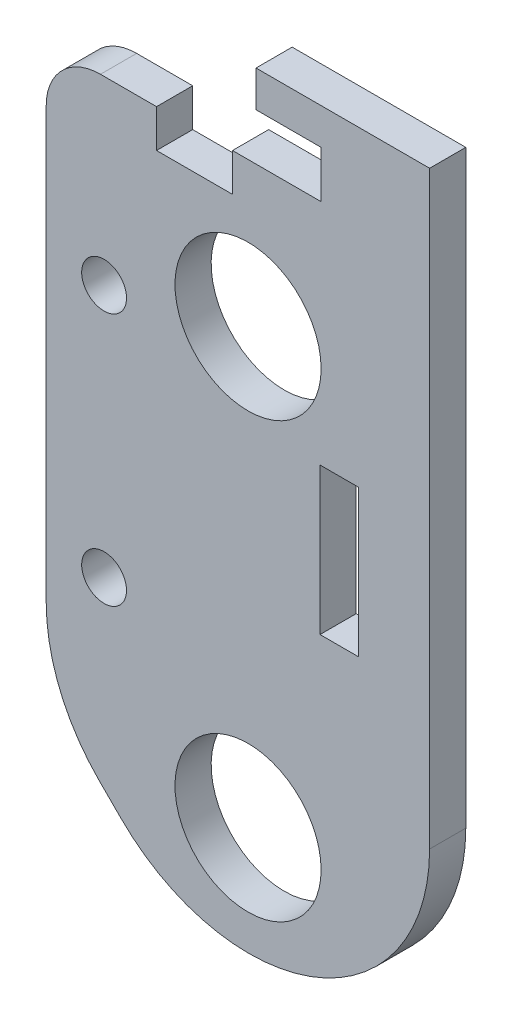
ISO-10303-21;
HEADER;
FILE_DESCRIPTION(('STEP AP214'),'2;1');
FILE_NAME('part.step','',(''),(''),'','','');
FILE_SCHEMA(('AUTOMOTIVE_DESIGN { 1 0 10303 214 1 1 1 1 }'));
ENDSEC;
DATA;
#1=APPLICATION_CONTEXT('core data for automotive mechanical design processes');
#2=APPLICATION_PROTOCOL_DEFINITION('international standard','automotive_design',2000,#1);
#3=PRODUCT_CONTEXT('',#1,'mechanical');
#4=PRODUCT('Part','Part','',(#3));
#5=PRODUCT_RELATED_PRODUCT_CATEGORY('part','',(#4));
#6=PRODUCT_DEFINITION_FORMATION('','',#4);
#7=PRODUCT_DEFINITION_CONTEXT('part definition',#1,'design');
#8=PRODUCT_DEFINITION('design','',#6,#7);
#9=PRODUCT_DEFINITION_SHAPE('','',#8);
#10=(LENGTH_UNIT() NAMED_UNIT(*) SI_UNIT(.MILLI.,.METRE.));
#11=(NAMED_UNIT(*) PLANE_ANGLE_UNIT() SI_UNIT($,.RADIAN.));
#12=(NAMED_UNIT(*) SI_UNIT($,.STERADIAN.) SOLID_ANGLE_UNIT());
#13=UNCERTAINTY_MEASURE_WITH_UNIT(LENGTH_MEASURE(1.E-05),#10,'distance_accuracy_value','');
#14=(GEOMETRIC_REPRESENTATION_CONTEXT(3) GLOBAL_UNCERTAINTY_ASSIGNED_CONTEXT((#13)) GLOBAL_UNIT_ASSIGNED_CONTEXT((#10,
#11,#12)) REPRESENTATION_CONTEXT('',''));
#15=CARTESIAN_POINT('',(0.,0.,0.));
#16=DIRECTION('',(0.,0.,1.));
#17=DIRECTION('',(1.,0.,0.));
#18=AXIS2_PLACEMENT_3D('',#15,#16,#17);
#19=CARTESIAN_POINT('',(-0.149999999999495,-37.6000017024481,5.));
#20=DIRECTION('',(1.,0.,0.));
#21=DIRECTION('',(0.,1.,0.));
#22=AXIS2_PLACEMENT_3D('',#19,#20,#21);
#23=PLANE('',#22);
#24=DIRECTION('',(0.,0.,1.));
#25=VECTOR('',#24,1.);
#26=CARTESIAN_POINT('',(-0.14999999999923,-57.9000017024481,5.));
#27=LINE('',#26,#25);
#28=CARTESIAN_POINT('',(-0.14999999999923,-57.9000017024481,0.));
#29=VERTEX_POINT('',#28);
#30=CARTESIAN_POINT('',(-0.14999999999923,-57.9000017024481,5.));
#31=VERTEX_POINT('',#30);
#32=EDGE_CURVE('E11',#29,#31,#27,.T.);
#33=ORIENTED_EDGE('',*,*,#32,.F.);
#34=DIRECTION('',(0.,1.,0.));
#35=VECTOR('',#34,1.);
#36=CARTESIAN_POINT('',(-0.149999999998459,0.,0.));
#37=LINE('',#36,#35);
#38=CARTESIAN_POINT('',(-0.149999999999495,-37.6000017024481,0.));
#39=VERTEX_POINT('',#38);
#40=EDGE_CURVE('E150',#29,#39,#37,.T.);
#41=ORIENTED_EDGE('',*,*,#40,.T.);
#42=DIRECTION('',(0.,0.,1.));
#43=VECTOR('',#42,1.);
#44=CARTESIAN_POINT('',(-0.149999999999495,-37.6000017024481,5.));
#45=LINE('',#44,#43);
#46=CARTESIAN_POINT('',(-0.149999999999495,-37.6000017024481,5.));
#47=VERTEX_POINT('',#46);
#48=EDGE_CURVE('E55',#39,#47,#45,.T.);
#49=ORIENTED_EDGE('',*,*,#48,.T.);
#50=DIRECTION('',(0.,1.,0.));
#51=VECTOR('',#50,1.);
#52=CARTESIAN_POINT('',(-0.149999999999495,-37.6000017024481,5.));
#53=LINE('',#52,#51);
#54=EDGE_CURVE('E238',#31,#47,#53,.T.);
#55=ORIENTED_EDGE('',*,*,#54,.F.);
#56=EDGE_LOOP('',(#33,#41,#49,#55));
#57=FACE_BOUND('',#56,.T.);
#58=ADVANCED_FACE('F45',(#57),#23,.T.);
#59=CARTESIAN_POINT('',(5.14999820052117,-37.6000017024481,5.));
#60=DIRECTION('',(0.,-1.,0.));
#61=DIRECTION('',(1.,0.,0.));
#62=AXIS2_PLACEMENT_3D('',#59,#60,#61);
#63=PLANE('',#62);
#64=ORIENTED_EDGE('',*,*,#48,.F.);
#65=DIRECTION('',(1.,0.,0.));
#66=VECTOR('',#65,1.);
#67=CARTESIAN_POINT('',(-5.00932651392036E-13,-37.6000017024481,0.));
#68=LINE('',#67,#66);
#69=CARTESIAN_POINT('',(5.14999820052117,-37.6000017024481,0.));
#70=VERTEX_POINT('',#69);
#71=EDGE_CURVE('E166',#39,#70,#68,.T.);
#72=ORIENTED_EDGE('',*,*,#71,.T.);
#73=DIRECTION('',(0.,0.,1.));
#74=VECTOR('',#73,1.);
#75=CARTESIAN_POINT('',(5.14999820052117,-37.6000017024481,5.));
#76=LINE('',#75,#74);
#77=CARTESIAN_POINT('',(5.14999820052117,-37.6000017024481,5.));
#78=VERTEX_POINT('',#77);
#79=EDGE_CURVE('E63',#70,#78,#76,.T.);
#80=ORIENTED_EDGE('',*,*,#79,.T.);
#81=DIRECTION('',(1.,0.,0.));
#82=VECTOR('',#81,1.);
#83=CARTESIAN_POINT('',(5.14999820052117,-37.6000017024481,5.));
#84=LINE('',#83,#82);
#85=EDGE_CURVE('E243',#47,#78,#84,.T.);
#86=ORIENTED_EDGE('',*,*,#85,.F.);
#87=EDGE_LOOP('',(#64,#72,#80,#86));
#88=FACE_BOUND('',#87,.T.);
#89=ADVANCED_FACE('F246',(#88),#63,.T.);
#90=CARTESIAN_POINT('',(5.14999820052117,-37.6000017024481,5.));
#91=DIRECTION('',(-1.,0.,0.));
#92=DIRECTION('',(0.,-1.,0.));
#93=AXIS2_PLACEMENT_3D('',#90,#91,#92);
#94=PLANE('',#93);
#95=ORIENTED_EDGE('',*,*,#79,.F.);
#96=DIRECTION('',(0.,1.,0.));
#97=VECTOR('',#96,1.);
#98=CARTESIAN_POINT('',(5.14999820052167,0.,0.));
#99=LINE('',#98,#97);
#100=CARTESIAN_POINT('',(5.14999820052148,-57.9000017024481,0.));
#101=VERTEX_POINT('',#100);
#102=EDGE_CURVE('E149',#70,#101,#99,.F.);
#103=ORIENTED_EDGE('',*,*,#102,.T.);
#104=DIRECTION('',(0.,0.,1.));
#105=VECTOR('',#104,1.);
#106=CARTESIAN_POINT('',(5.14999820052148,-57.9000017024481,5.));
#107=LINE('',#106,#105);
#108=CARTESIAN_POINT('',(5.14999820052148,-57.9000017024481,5.));
#109=VERTEX_POINT('',#108);
#110=EDGE_CURVE('E49',#101,#109,#107,.T.);
#111=ORIENTED_EDGE('',*,*,#110,.T.);
#112=DIRECTION('',(0.,-1.,0.));
#113=VECTOR('',#112,1.);
#114=CARTESIAN_POINT('',(5.14999820052117,-37.6000017024481,5.));
#115=LINE('',#114,#113);
#116=EDGE_CURVE('E438',#78,#109,#115,.T.);
#117=ORIENTED_EDGE('',*,*,#116,.F.);
#118=EDGE_LOOP('',(#95,#103,#111,#117));
#119=FACE_BOUND('',#118,.T.);
#120=ADVANCED_FACE('F153',(#119),#94,.T.);
#121=CARTESIAN_POINT('',(-30.4999999999999,-13.4999999999996,5.));
#122=DIRECTION('',(0.,0.,1.));
#123=DIRECTION('',(0.,-1.,0.));
#124=AXIS2_PLACEMENT_3D('',#121,#122,#123);
#125=CYLINDRICAL_SURFACE('',#124,7.5);
#126=DIRECTION('',(0.,0.,1.));
#127=VECTOR('',#126,1.);
#128=CARTESIAN_POINT('',(-30.4999999999999,-5.99999999999958,5.));
#129=LINE('',#128,#127);
#130=CARTESIAN_POINT('',(-30.4999999999999,-5.99999999999958,0.));
#131=VERTEX_POINT('',#130);
#132=CARTESIAN_POINT('',(-30.4999999999999,-5.99999999999958,5.));
#133=VERTEX_POINT('',#132);
#134=EDGE_CURVE('E143',#131,#133,#129,.T.);
#135=ORIENTED_EDGE('',*,*,#134,.F.);
#136=CARTESIAN_POINT('',(-30.4999999999999,-13.4999999999996,0.));
#137=DIRECTION('',(0.,0.,1.));
#138=DIRECTION('',(0.,-1.,0.));
#139=AXIS2_PLACEMENT_3D('',#136,#137,#138);
#140=CIRCLE('',#139,7.5);
#141=CARTESIAN_POINT('',(-37.9999999999997,-13.4999999999994,0.));
#142=VERTEX_POINT('',#141);
#143=EDGE_CURVE('E317',#131,#142,#140,.T.);
#144=ORIENTED_EDGE('',*,*,#143,.T.);
#145=DIRECTION('',(0.,0.,1.));
#146=VECTOR('',#145,1.);
#147=CARTESIAN_POINT('',(-37.9999999999997,-13.4999999999994,5.));
#148=LINE('',#147,#146);
#149=CARTESIAN_POINT('',(-37.9999999999997,-13.4999999999994,5.));
#150=VERTEX_POINT('',#149);
#151=EDGE_CURVE('E228',#142,#150,#148,.T.);
#152=ORIENTED_EDGE('',*,*,#151,.T.);
#153=CARTESIAN_POINT('',(-30.4999999999999,-13.4999999999996,5.));
#154=DIRECTION('',(0.,0.,1.));
#155=DIRECTION('',(1.,0.,0.));
#156=AXIS2_PLACEMENT_3D('',#153,#154,#155);
#157=CIRCLE('',#156,7.5);
#158=EDGE_CURVE('E379',#133,#150,#157,.T.);
#159=ORIENTED_EDGE('',*,*,#158,.F.);
#160=EDGE_LOOP('',(#135,#144,#152,#159));
#161=FACE_BOUND('',#160,.T.);
#162=ADVANCED_FACE('F378',(#161),#125,.T.);
#163=CARTESIAN_POINT('',(-37.9999999999997,5.0626169922907E-13,5.));
#164=DIRECTION('',(-1.,0.,0.));
#165=DIRECTION('',(0.,-1.,0.));
#166=AXIS2_PLACEMENT_3D('',#163,#164,#165);
#167=PLANE('',#166);
#168=ORIENTED_EDGE('',*,*,#151,.F.);
#169=DIRECTION('',(0.,1.,0.));
#170=VECTOR('',#169,1.);
#171=CARTESIAN_POINT('',(-37.9999999999995,5.06261699229065E-13,0.));
#172=LINE('',#171,#170);
#173=CARTESIAN_POINT('',(-37.9999999999989,-72.9669914110084,0.));
#174=VERTEX_POINT('',#173);
#175=EDGE_CURVE('E314',#142,#174,#172,.F.);
#176=ORIENTED_EDGE('',*,*,#175,.T.);
#177=DIRECTION('',(0.,0.,1.));
#178=VECTOR('',#177,1.);
#179=CARTESIAN_POINT('',(-37.9999999999989,-72.9669914110084,4.99999999999999));
#180=LINE('',#179,#178);
#181=CARTESIAN_POINT('',(-37.9999999999989,-72.9669914110084,4.99999999999999));
#182=VERTEX_POINT('',#181);
#183=EDGE_CURVE('E225',#174,#182,#180,.T.);
#184=ORIENTED_EDGE('',*,*,#183,.T.);
#185=DIRECTION('',(0.,-1.,0.));
#186=VECTOR('',#185,1.);
#187=CARTESIAN_POINT('',(-37.9999999999997,5.0626169922907E-13,5.));
#188=LINE('',#187,#186);
#189=EDGE_CURVE('E385',#150,#182,#188,.T.);
#190=ORIENTED_EDGE('',*,*,#189,.F.);
#191=EDGE_LOOP('',(#168,#176,#184,#190));
#192=FACE_BOUND('',#191,.T.);
#193=ADVANCED_FACE('F390',(#192),#167,.T.);
#194=CARTESIAN_POINT('',(-12.999999999999,-72.966991411009,5.));
#195=DIRECTION('',(0.,0.,1.));
#196=DIRECTION('',(0.,-1.,0.));
#197=AXIS2_PLACEMENT_3D('',#194,#195,#196);
#198=CYLINDRICAL_SURFACE('',#197,25.);
#199=ORIENTED_EDGE('',*,*,#183,.F.);
#200=CARTESIAN_POINT('',(-12.999999999999,-72.966991411009,0.));
#201=DIRECTION('',(0.,0.,1.));
#202=DIRECTION('',(0.,-1.,0.));
#203=AXIS2_PLACEMENT_3D('',#200,#201,#202);
#204=CIRCLE('',#203,25.);
#205=CARTESIAN_POINT('',(-30.6776695296623,-90.6446609406722,0.));
#206=VERTEX_POINT('',#205);
#207=EDGE_CURVE('E310',#174,#206,#204,.T.);
#208=ORIENTED_EDGE('',*,*,#207,.T.);
#209=DIRECTION('',(0.,0.,1.));
#210=VECTOR('',#209,1.);
#211=CARTESIAN_POINT('',(-30.6776695296623,-90.6446609406722,5.));
#212=LINE('',#211,#210);
#213=CARTESIAN_POINT('',(-30.6776695296623,-90.6446609406722,5.));
#214=VERTEX_POINT('',#213);
#215=EDGE_CURVE('E222',#206,#214,#212,.T.);
#216=ORIENTED_EDGE('',*,*,#215,.T.);
#217=CARTESIAN_POINT('',(-12.999999999999,-72.966991411009,5.));
#218=DIRECTION('',(0.,0.,1.));
#219=DIRECTION('',(1.,0.,0.));
#220=AXIS2_PLACEMENT_3D('',#217,#218,#219);
#221=CIRCLE('',#220,25.);
#222=EDGE_CURVE('E392',#182,#214,#221,.T.);
#223=ORIENTED_EDGE('',*,*,#222,.F.);
#224=EDGE_LOOP('',(#199,#208,#216,#223));
#225=FACE_BOUND('',#224,.T.);
#226=ADVANCED_FACE('F506',(#225),#198,.T.);
#227=CARTESIAN_POINT('',(-60.6611652351669,-60.6611652351678,5.));
#228=DIRECTION('',(-0.707106781186544,-0.707106781186551,0.));
#229=DIRECTION('',(0.70710678118656,-0.707106781186553,0.));
#230=AXIS2_PLACEMENT_3D('',#227,#228,#229);
#231=PLANE('',#230);
#232=ORIENTED_EDGE('',*,*,#215,.F.);
#233=DIRECTION('',(0.70710678118656,-0.707106781186553,0.));
#234=VECTOR('',#233,1.);
#235=CARTESIAN_POINT('',(-60.6611652351669,-60.6611652351678,0.));
#236=LINE('',#235,#234);
#237=CARTESIAN_POINT('',(-27.6446609406713,-93.6776695296632,0.));
#238=VERTEX_POINT('',#237);
#239=EDGE_CURVE('E306',#206,#238,#236,.T.);
#240=ORIENTED_EDGE('',*,*,#239,.T.);
#241=DIRECTION('',(0.,0.,1.));
#242=VECTOR('',#241,1.);
#243=CARTESIAN_POINT('',(-27.6446609406713,-93.6776695296632,5.));
#244=LINE('',#243,#242);
#245=CARTESIAN_POINT('',(-27.6446609406713,-93.6776695296632,5.));
#246=VERTEX_POINT('',#245);
#247=EDGE_CURVE('E219',#238,#246,#244,.T.);
#248=ORIENTED_EDGE('',*,*,#247,.T.);
#249=DIRECTION('',(0.70710678118656,-0.707106781186553,0.));
#250=VECTOR('',#249,1.);
#251=CARTESIAN_POINT('',(-60.6611652351669,-60.6611652351678,5.));
#252=LINE('',#251,#250);
#253=EDGE_CURVE('E396',#214,#246,#252,.T.);
#254=ORIENTED_EDGE('',*,*,#253,.F.);
#255=EDGE_LOOP('',(#232,#240,#248,#254));
#256=FACE_BOUND('',#255,.T.);
#257=ADVANCED_FACE('F504',(#256),#231,.T.);
#258=CARTESIAN_POINT('',(-9.96699141100797,-76.,5.));
#259=DIRECTION('',(0.,0.,1.));
#260=DIRECTION('',(0.,-1.,0.));
#261=AXIS2_PLACEMENT_3D('',#258,#259,#260);
#262=CYLINDRICAL_SURFACE('',#261,25.);
#263=ORIENTED_EDGE('',*,*,#247,.F.);
#264=CARTESIAN_POINT('',(-9.96699141100797,-76.,0.));
#265=DIRECTION('',(0.,0.,1.));
#266=DIRECTION('',(0.,-1.,0.));
#267=AXIS2_PLACEMENT_3D('',#264,#265,#266);
#268=CIRCLE('',#267,25.);
#269=CARTESIAN_POINT('',(-9.98349570550315,-101.,0.));
#270=VERTEX_POINT('',#269);
#271=EDGE_CURVE('E302',#238,#270,#268,.T.);
#272=ORIENTED_EDGE('',*,*,#271,.T.);
#273=DIRECTION('',(0.,0.,1.));
#274=VECTOR('',#273,1.);
#275=CARTESIAN_POINT('',(-9.98349570550315,-101.,5.));
#276=LINE('',#275,#274);
#277=CARTESIAN_POINT('',(-9.98349570550315,-101.,5.));
#278=VERTEX_POINT('',#277);
#279=EDGE_CURVE('E216',#270,#278,#276,.T.);
#280=ORIENTED_EDGE('',*,*,#279,.T.);
#281=CARTESIAN_POINT('',(-9.96699141100797,-76.,5.));
#282=DIRECTION('',(0.,0.,1.));
#283=DIRECTION('',(1.,0.,0.));
#284=AXIS2_PLACEMENT_3D('',#281,#282,#283);
#285=CIRCLE('',#284,25.);
#286=EDGE_CURVE('E403',#246,#278,#285,.T.);
#287=ORIENTED_EDGE('',*,*,#286,.F.);
#288=EDGE_LOOP('',(#263,#272,#280,#287));
#289=FACE_BOUND('',#288,.T.);
#290=ADVANCED_FACE('F499',(#289),#262,.T.);
#291=CARTESIAN_POINT('',(-9.99999999999903,-76.,5.));
#292=DIRECTION('',(0.,0.,1.));
#293=DIRECTION('',(0.,-1.,0.));
#294=AXIS2_PLACEMENT_3D('',#291,#292,#293);
#295=CYLINDRICAL_SURFACE('',#294,25.);
#296=ORIENTED_EDGE('',*,*,#279,.F.);
#297=CARTESIAN_POINT('',(-9.99999999999903,-76.,0.));
#298=DIRECTION('',(0.,0.,1.));
#299=DIRECTION('',(0.,-1.,0.));
#300=AXIS2_PLACEMENT_3D('',#297,#298,#299);
#301=CIRCLE('',#300,25.);
#302=CARTESIAN_POINT('',(15.000000000001,-76.,0.));
#303=VERTEX_POINT('',#302);
#304=EDGE_CURVE('E298',#270,#303,#301,.T.);
#305=ORIENTED_EDGE('',*,*,#304,.T.);
#306=DIRECTION('',(0.,0.,1.));
#307=VECTOR('',#306,1.);
#308=CARTESIAN_POINT('',(15.000000000001,-76.,4.99999999999999));
#309=LINE('',#308,#307);
#310=CARTESIAN_POINT('',(15.000000000001,-76.,4.99999999999999));
#311=VERTEX_POINT('',#310);
#312=EDGE_CURVE('E213',#303,#311,#309,.T.);
#313=ORIENTED_EDGE('',*,*,#312,.T.);
#314=CARTESIAN_POINT('',(-9.99999999999903,-76.,5.));
#315=DIRECTION('',(0.,0.,1.));
#316=DIRECTION('',(1.,0.,0.));
#317=AXIS2_PLACEMENT_3D('',#314,#315,#316);
#318=CIRCLE('',#317,25.);
#319=EDGE_CURVE('E407',#278,#311,#318,.T.);
#320=ORIENTED_EDGE('',*,*,#319,.F.);
#321=EDGE_LOOP('',(#296,#305,#313,#320));
#322=FACE_BOUND('',#321,.T.);
#323=ADVANCED_FACE('F495',(#322),#295,.T.);
#324=CARTESIAN_POINT('',(15.,-1.99840144432528E-13,4.99999999999999));
#325=DIRECTION('',(-1.,0.,0.));
#326=DIRECTION('',(0.,-1.,0.));
#327=AXIS2_PLACEMENT_3D('',#324,#325,#326);
#328=PLANE('',#327);
#329=ORIENTED_EDGE('',*,*,#312,.F.);
#330=DIRECTION('',(0.,1.,0.));
#331=VECTOR('',#330,1.);
#332=CARTESIAN_POINT('',(14.9999999999999,-1.99840144432526E-13,0.));
#333=LINE('',#332,#331);
#334=CARTESIAN_POINT('',(14.9999999999999,5.4999999999998,0.));
#335=VERTEX_POINT('',#334);
#336=EDGE_CURVE('E294',#335,#303,#333,.F.);
#337=ORIENTED_EDGE('',*,*,#336,.F.);
#338=DIRECTION('',(0.,0.,1.));
#339=VECTOR('',#338,1.);
#340=CARTESIAN_POINT('',(14.9999999999999,5.4999999999998,4.99999999999999));
#341=LINE('',#340,#339);
#342=CARTESIAN_POINT('',(14.9999999999999,5.4999999999998,4.99999999999999));
#343=VERTEX_POINT('',#342);
#344=EDGE_CURVE('E210',#335,#343,#341,.T.);
#345=ORIENTED_EDGE('',*,*,#344,.T.);
#346=DIRECTION('',(0.,-1.,0.));
#347=VECTOR('',#346,1.);
#348=CARTESIAN_POINT('',(15.,-1.99840144432528E-13,4.99999999999999));
#349=LINE('',#348,#347);
#350=EDGE_CURVE('E411',#343,#311,#349,.T.);
#351=ORIENTED_EDGE('',*,*,#350,.T.);
#352=EDGE_LOOP('',(#329,#337,#345,#351));
#353=FACE_BOUND('',#352,.T.);
#354=ADVANCED_FACE('F492',(#353),#328,.F.);
#355=CARTESIAN_POINT('',(0.,5.50000000000001,5.));
#356=DIRECTION('',(0.,-1.,0.));
#357=DIRECTION('',(1.,0.,0.));
#358=AXIS2_PLACEMENT_3D('',#355,#356,#357);
#359=PLANE('',#358);
#360=ORIENTED_EDGE('',*,*,#344,.F.);
#361=DIRECTION('',(1.,0.,0.));
#362=VECTOR('',#361,1.);
#363=CARTESIAN_POINT('',(0.,5.50000000000003,0.));
#364=LINE('',#363,#362);
#365=CARTESIAN_POINT('',(-9.00000000000007,5.50000000000015,0.));
#366=VERTEX_POINT('',#365);
#367=EDGE_CURVE('E290',#366,#335,#364,.T.);
#368=ORIENTED_EDGE('',*,*,#367,.F.);
#369=DIRECTION('',(0.,0.,1.));
#370=VECTOR('',#369,1.);
#371=CARTESIAN_POINT('',(-9.00000000000007,5.50000000000015,5.));
#372=LINE('',#371,#370);
#373=CARTESIAN_POINT('',(-9.00000000000007,5.50000000000015,5.));
#374=VERTEX_POINT('',#373);
#375=EDGE_CURVE('E207',#366,#374,#372,.T.);
#376=ORIENTED_EDGE('',*,*,#375,.T.);
#377=DIRECTION('',(1.,0.,0.));
#378=VECTOR('',#377,1.);
#379=CARTESIAN_POINT('',(0.,5.50000000000001,5.));
#380=LINE('',#379,#378);
#381=EDGE_CURVE('E415',#374,#343,#380,.T.);
#382=ORIENTED_EDGE('',*,*,#381,.T.);
#383=EDGE_LOOP('',(#360,#368,#376,#382));
#384=FACE_BOUND('',#383,.T.);
#385=ADVANCED_FACE('F487',(#384),#359,.F.);
#386=CARTESIAN_POINT('',(-9.,1.33781874467331E-13,5.));
#387=DIRECTION('',(1.,0.,0.));
#388=DIRECTION('',(0.,1.,0.));
#389=AXIS2_PLACEMENT_3D('',#386,#387,#388);
#390=PLANE('',#389);
#391=ORIENTED_EDGE('',*,*,#375,.F.);
#392=DIRECTION('',(0.,1.,0.));
#393=VECTOR('',#392,1.);
#394=CARTESIAN_POINT('',(-9.00000000000001,1.19904086659517E-13,0.));
#395=LINE('',#394,#393);
#396=CARTESIAN_POINT('',(-9.,0.500000000000136,0.));
#397=VERTEX_POINT('',#396);
#398=EDGE_CURVE('E286',#397,#366,#395,.T.);
#399=ORIENTED_EDGE('',*,*,#398,.F.);
#400=DIRECTION('',(0.,0.,1.));
#401=VECTOR('',#400,1.);
#402=CARTESIAN_POINT('',(-9.,0.500000000000136,5.));
#403=LINE('',#402,#401);
#404=CARTESIAN_POINT('',(-9.,0.500000000000136,5.));
#405=VERTEX_POINT('',#404);
#406=EDGE_CURVE('E204',#397,#405,#403,.T.);
#407=ORIENTED_EDGE('',*,*,#406,.T.);
#408=DIRECTION('',(0.,1.,0.));
#409=VECTOR('',#408,1.);
#410=CARTESIAN_POINT('',(-9.,1.33781874467331E-13,5.));
#411=LINE('',#410,#409);
#412=EDGE_CURVE('E419',#405,#374,#411,.T.);
#413=ORIENTED_EDGE('',*,*,#412,.T.);
#414=EDGE_LOOP('',(#391,#399,#407,#413));
#415=FACE_BOUND('',#414,.T.);
#416=ADVANCED_FACE('F483',(#415),#390,.F.);
#417=CARTESIAN_POINT('',(0.,0.5,5.));
#418=DIRECTION('',(0.,-1.,0.));
#419=DIRECTION('',(1.,0.,0.));
#420=AXIS2_PLACEMENT_3D('',#417,#418,#419);
#421=PLANE('',#420);
#422=ORIENTED_EDGE('',*,*,#406,.F.);
#423=DIRECTION('',(1.,0.,0.));
#424=VECTOR('',#423,1.);
#425=CARTESIAN_POINT('',(0.,0.500000000000016,0.));
#426=LINE('',#425,#424);
#427=CARTESIAN_POINT('',(0.,0.5,0.));
#428=VERTEX_POINT('',#427);
#429=EDGE_CURVE('E282',#397,#428,#426,.T.);
#430=ORIENTED_EDGE('',*,*,#429,.T.);
#431=DIRECTION('',(0.,0.,1.));
#432=VECTOR('',#431,1.);
#433=CARTESIAN_POINT('',(0.,0.5,5.));
#434=LINE('',#433,#432);
#435=CARTESIAN_POINT('',(0.,0.5,5.));
#436=VERTEX_POINT('',#435);
#437=EDGE_CURVE('E201',#428,#436,#434,.T.);
#438=ORIENTED_EDGE('',*,*,#437,.T.);
#439=DIRECTION('',(1.,0.,0.));
#440=VECTOR('',#439,1.);
#441=CARTESIAN_POINT('',(0.,0.5,5.));
#442=LINE('',#441,#440);
#443=EDGE_CURVE('E423',#405,#436,#442,.T.);
#444=ORIENTED_EDGE('',*,*,#443,.F.);
#445=EDGE_LOOP('',(#422,#430,#438,#444));
#446=FACE_BOUND('',#445,.T.);
#447=ADVANCED_FACE('F479',(#446),#421,.T.);
#448=CARTESIAN_POINT('',(0.,0.,5.));
#449=DIRECTION('',(-1.,0.,0.));
#450=DIRECTION('',(0.,-1.,0.));
#451=AXIS2_PLACEMENT_3D('',#448,#449,#450);
#452=PLANE('',#451);
#453=ORIENTED_EDGE('',*,*,#437,.F.);
#454=DIRECTION('',(0.,1.,0.));
#455=VECTOR('',#454,1.);
#456=CARTESIAN_POINT('',(0.,0.,0.));
#457=LINE('',#456,#455);
#458=CARTESIAN_POINT('',(0.,-6.,0.));
#459=VERTEX_POINT('',#458);
#460=EDGE_CURVE('E278',#428,#459,#457,.F.);
#461=ORIENTED_EDGE('',*,*,#460,.T.);
#462=DIRECTION('',(0.,0.,1.));
#463=VECTOR('',#462,1.);
#464=CARTESIAN_POINT('',(0.,-6.,5.));
#465=LINE('',#464,#463);
#466=CARTESIAN_POINT('',(0.,-6.,5.));
#467=VERTEX_POINT('',#466);
#468=EDGE_CURVE('E198',#459,#467,#465,.T.);
#469=ORIENTED_EDGE('',*,*,#468,.T.);
#470=DIRECTION('',(0.,-1.,0.));
#471=VECTOR('',#470,1.);
#472=CARTESIAN_POINT('',(0.,0.,5.));
#473=LINE('',#472,#471);
#474=EDGE_CURVE('E427',#436,#467,#473,.T.);
#475=ORIENTED_EDGE('',*,*,#474,.F.);
#476=EDGE_LOOP('',(#453,#461,#469,#475));
#477=FACE_BOUND('',#476,.T.);
#478=ADVANCED_FACE('F475',(#477),#452,.T.);
#479=CARTESIAN_POINT('',(0.,-6.,5.));
#480=DIRECTION('',(0.,1.,0.));
#481=DIRECTION('',(-1.,0.,0.));
#482=AXIS2_PLACEMENT_3D('',#479,#480,#481);
#483=PLANE('',#482);
#484=ORIENTED_EDGE('',*,*,#468,.F.);
#485=DIRECTION('',(1.,0.,0.));
#486=VECTOR('',#485,1.);
#487=CARTESIAN_POINT('',(0.,-6.,0.));
#488=LINE('',#487,#486);
#489=CARTESIAN_POINT('',(-12.2499999999999,-5.99999999999982,0.));
#490=VERTEX_POINT('',#489);
#491=EDGE_CURVE('E274',#459,#490,#488,.F.);
#492=ORIENTED_EDGE('',*,*,#491,.T.);
#493=DIRECTION('',(0.,0.,1.));
#494=VECTOR('',#493,1.);
#495=CARTESIAN_POINT('',(-12.2499999999999,-5.99999999999982,5.));
#496=LINE('',#495,#494);
#497=CARTESIAN_POINT('',(-12.2499999999999,-5.99999999999982,5.));
#498=VERTEX_POINT('',#497);
#499=EDGE_CURVE('E195',#490,#498,#496,.T.);
#500=ORIENTED_EDGE('',*,*,#499,.T.);
#501=DIRECTION('',(-1.,0.,0.));
#502=VECTOR('',#501,1.);
#503=CARTESIAN_POINT('',(0.,-6.,5.));
#504=LINE('',#503,#502);
#505=EDGE_CURVE('E431',#467,#498,#504,.T.);
#506=ORIENTED_EDGE('',*,*,#505,.F.);
#507=EDGE_LOOP('',(#484,#492,#500,#506));
#508=FACE_BOUND('',#507,.T.);
#509=ADVANCED_FACE('F473',(#508),#483,.T.);
#510=CARTESIAN_POINT('',(-12.25,1.63202784619898E-13,5.));
#511=DIRECTION('',(1.,0.,0.));
#512=DIRECTION('',(0.,1.,0.));
#513=AXIS2_PLACEMENT_3D('',#510,#511,#512);
#514=PLANE('',#513);
#515=ORIENTED_EDGE('',*,*,#499,.F.);
#516=DIRECTION('',(0.,1.,0.));
#517=VECTOR('',#516,1.);
#518=CARTESIAN_POINT('',(-12.2499999999997,1.63202784619894E-13,0.));
#519=LINE('',#518,#517);
#520=CARTESIAN_POINT('',(-12.2499999999999,-11.2499999999999,0.));
#521=VERTEX_POINT('',#520);
#522=EDGE_CURVE('E160',#521,#490,#519,.T.);
#523=ORIENTED_EDGE('',*,*,#522,.F.);
#524=DIRECTION('',(0.,0.,1.));
#525=VECTOR('',#524,1.);
#526=CARTESIAN_POINT('',(-12.2499999999999,-11.2499999999999,5.));
#527=LINE('',#526,#525);
#528=CARTESIAN_POINT('',(-12.2499999999999,-11.2499999999999,5.));
#529=VERTEX_POINT('',#528);
#530=EDGE_CURVE('E191',#521,#529,#527,.T.);
#531=ORIENTED_EDGE('',*,*,#530,.T.);
#532=DIRECTION('',(0.,1.,0.));
#533=VECTOR('',#532,1.);
#534=CARTESIAN_POINT('',(-12.25,1.63202784619898E-13,5.));
#535=LINE('',#534,#533);
#536=EDGE_CURVE('E432',#529,#498,#535,.T.);
#537=ORIENTED_EDGE('',*,*,#536,.T.);
#538=EDGE_LOOP('',(#515,#523,#531,#537));
#539=FACE_BOUND('',#538,.T.);
#540=ADVANCED_FACE('F469',(#539),#514,.F.);
#541=CARTESIAN_POINT('',(1.49880108324396E-13,-11.25,5.));
#542=DIRECTION('',(0.,-1.,0.));
#543=DIRECTION('',(1.,0.,0.));
#544=AXIS2_PLACEMENT_3D('',#541,#542,#543);
#545=PLANE('',#544);
#546=ORIENTED_EDGE('',*,*,#530,.F.);
#547=DIRECTION('',(1.,0.,0.));
#548=VECTOR('',#547,1.);
#549=CARTESIAN_POINT('',(-1.49880108324396E-13,-11.25,0.));
#550=LINE('',#549,#548);
#551=CARTESIAN_POINT('',(-22.7499999999999,-11.2499999999997,0.));
#552=VERTEX_POINT('',#551);
#553=EDGE_CURVE('E155',#552,#521,#550,.T.);
#554=ORIENTED_EDGE('',*,*,#553,.F.);
#555=DIRECTION('',(0.,0.,1.));
#556=VECTOR('',#555,1.);
#557=CARTESIAN_POINT('',(-22.7499999999999,-11.2499999999997,5.));
#558=LINE('',#557,#556);
#559=CARTESIAN_POINT('',(-22.7499999999999,-11.2499999999997,5.));
#560=VERTEX_POINT('',#559);
#561=EDGE_CURVE('E188',#552,#560,#558,.T.);
#562=ORIENTED_EDGE('',*,*,#561,.T.);
#563=DIRECTION('',(1.,0.,0.));
#564=VECTOR('',#563,1.);
#565=CARTESIAN_POINT('',(1.49880108324396E-13,-11.25,5.));
#566=LINE('',#565,#564);
#567=EDGE_CURVE('E346',#560,#529,#566,.T.);
#568=ORIENTED_EDGE('',*,*,#567,.T.);
#569=EDGE_LOOP('',(#546,#554,#562,#568));
#570=FACE_BOUND('',#569,.T.);
#571=ADVANCED_FACE('F344',(#570),#545,.F.);
#572=CARTESIAN_POINT('',(-22.75,3.16968673530483E-13,5.));
#573=DIRECTION('',(-1.,0.,0.));
#574=DIRECTION('',(0.,-1.,0.));
#575=AXIS2_PLACEMENT_3D('',#572,#573,#574);
#576=PLANE('',#575);
#577=ORIENTED_EDGE('',*,*,#561,.F.);
#578=DIRECTION('',(0.,1.,0.));
#579=VECTOR('',#578,1.);
#580=CARTESIAN_POINT('',(-22.7499999999998,3.03090885722665E-13,0.));
#581=LINE('',#580,#579);
#582=CARTESIAN_POINT('',(-22.7499999999999,-5.99999999999968,0.));
#583=VERTEX_POINT('',#582);
#584=EDGE_CURVE('E267',#583,#552,#581,.F.);
#585=ORIENTED_EDGE('',*,*,#584,.F.);
#586=DIRECTION('',(0.,0.,1.));
#587=VECTOR('',#586,1.);
#588=CARTESIAN_POINT('',(-22.7499999999999,-5.99999999999968,5.));
#589=LINE('',#588,#587);
#590=CARTESIAN_POINT('',(-22.7499999999999,-5.99999999999968,5.));
#591=VERTEX_POINT('',#590);
#592=EDGE_CURVE('E192',#583,#591,#589,.T.);
#593=ORIENTED_EDGE('',*,*,#592,.T.);
#594=DIRECTION('',(0.,-1.,0.));
#595=VECTOR('',#594,1.);
#596=CARTESIAN_POINT('',(-22.75,3.16968673530483E-13,5.));
#597=LINE('',#596,#595);
#598=EDGE_CURVE('E187',#591,#560,#597,.T.);
#599=ORIENTED_EDGE('',*,*,#598,.T.);
#600=EDGE_LOOP('',(#577,#585,#593,#599));
#601=FACE_BOUND('',#600,.T.);
#602=ADVANCED_FACE('F337',(#601),#576,.F.);
#603=DIRECTION('',(1.,0.,0.));
#604=VECTOR('',#603,1.);
#605=CARTESIAN_POINT('',(0.,-5.99999999999998,0.));
#606=LINE('',#605,#604);
#607=EDGE_CURVE('E164',#583,#131,#606,.F.);
#608=ORIENTED_EDGE('',*,*,#607,.T.);
#609=ORIENTED_EDGE('',*,*,#134,.T.);
#610=EDGE_CURVE('E387',#591,#133,#504,.T.);
#611=ORIENTED_EDGE('',*,*,#610,.F.);
#612=ORIENTED_EDGE('',*,*,#592,.F.);
#613=EDGE_LOOP('',(#608,#609,#611,#612));
#614=FACE_BOUND('',#613,.T.);
#615=ADVANCED_FACE('F328',(#614),#483,.T.);
#616=CARTESIAN_POINT('',(5.14999820052148,-57.9000017024481,5.));
#617=DIRECTION('',(0.,1.,0.));
#618=DIRECTION('',(-1.,0.,0.));
#619=AXIS2_PLACEMENT_3D('',#616,#617,#618);
#620=PLANE('',#619);
#621=DIRECTION('',(1.,0.,0.));
#622=VECTOR('',#621,1.);
#623=CARTESIAN_POINT('',(-7.71382980190723E-13,-57.900001702448,0.));
#624=LINE('',#623,#622);
#625=EDGE_CURVE('E136',#101,#29,#624,.F.);
#626=ORIENTED_EDGE('',*,*,#625,.T.);
#627=ORIENTED_EDGE('',*,*,#32,.T.);
#628=DIRECTION('',(-1.,0.,0.));
#629=VECTOR('',#628,1.);
#630=CARTESIAN_POINT('',(5.14999820052148,-57.9000017024481,5.));
#631=LINE('',#630,#629);
#632=EDGE_CURVE('E139',#109,#31,#631,.T.);
#633=ORIENTED_EDGE('',*,*,#632,.F.);
#634=ORIENTED_EDGE('',*,*,#110,.F.);
#635=EDGE_LOOP('',(#626,#627,#633,#634));
#636=FACE_BOUND('',#635,.T.);
#637=ADVANCED_FACE('F135',(#636),#620,.T.);
#638=CARTESIAN_POINT('',(-29.999999999999,-65.9999999999994,5.));
#639=DIRECTION('',(0.,0.,1.));
#640=DIRECTION('',(0.,-1.,0.));
#641=AXIS2_PLACEMENT_3D('',#638,#639,#640);
#642=CYLINDRICAL_SURFACE('',#641,3.1);
#643=CARTESIAN_POINT('',(-29.999999999999,-65.9999999999994,5.));
#644=DIRECTION('',(0.,0.,1.));
#645=DIRECTION('',(1.,0.,0.));
#646=AXIS2_PLACEMENT_3D('',#643,#644,#645);
#647=CIRCLE('',#646,3.1);
#648=CARTESIAN_POINT('',(-26.899999999999,-65.9999999999995,5.));
#649=VERTEX_POINT('',#648);
#650=EDGE_CURVE('E248',#649,#649,#647,.T.);
#651=ORIENTED_EDGE('',*,*,#650,.T.);
#652=EDGE_LOOP('',(#651));
#653=FACE_BOUND('',#652,.T.);
#654=CARTESIAN_POINT('',(-29.999999999999,-65.9999999999994,0.));
#655=DIRECTION('',(0.,0.,1.));
#656=DIRECTION('',(0.,-1.,0.));
#657=AXIS2_PLACEMENT_3D('',#654,#655,#656);
#658=CIRCLE('',#657,3.1);
#659=CARTESIAN_POINT('',(-29.999999999999,-69.0999999999995,0.));
#660=VERTEX_POINT('',#659);
#661=EDGE_CURVE('E169',#660,#660,#658,.T.);
#662=ORIENTED_EDGE('',*,*,#661,.F.);
#663=EDGE_LOOP('',(#662));
#664=FACE_BOUND('',#663,.T.);
#665=ADVANCED_FACE('F525',(#653,#664),#642,.F.);
#666=CARTESIAN_POINT('',(-29.9999999999996,-30.9999999999996,5.));
#667=DIRECTION('',(0.,0.,1.));
#668=DIRECTION('',(0.,-1.,0.));
#669=AXIS2_PLACEMENT_3D('',#666,#667,#668);
#670=CYLINDRICAL_SURFACE('',#669,3.1);
#671=CARTESIAN_POINT('',(-29.9999999999996,-30.9999999999996,5.));
#672=DIRECTION('',(0.,0.,1.));
#673=DIRECTION('',(1.,0.,0.));
#674=AXIS2_PLACEMENT_3D('',#671,#672,#673);
#675=CIRCLE('',#674,3.1);
#676=CARTESIAN_POINT('',(-26.8999999999996,-30.9999999999996,5.));
#677=VERTEX_POINT('',#676);
#678=EDGE_CURVE('E253',#677,#677,#675,.T.);
#679=ORIENTED_EDGE('',*,*,#678,.T.);
#680=EDGE_LOOP('',(#679));
#681=FACE_BOUND('',#680,.T.);
#682=CARTESIAN_POINT('',(-29.9999999999996,-30.9999999999996,0.));
#683=DIRECTION('',(0.,0.,1.));
#684=DIRECTION('',(0.,-1.,0.));
#685=AXIS2_PLACEMENT_3D('',#682,#683,#684);
#686=CIRCLE('',#685,3.1);
#687=CARTESIAN_POINT('',(-29.9999999999996,-34.0999999999996,0.));
#688=VERTEX_POINT('',#687);
#689=EDGE_CURVE('E175',#688,#688,#686,.T.);
#690=ORIENTED_EDGE('',*,*,#689,.F.);
#691=EDGE_LOOP('',(#690));
#692=FACE_BOUND('',#691,.T.);
#693=ADVANCED_FACE('F528',(#681,#692),#670,.F.);
#694=CARTESIAN_POINT('',(-10.0999999999989,-86.,5.));
#695=DIRECTION('',(0.,0.,1.));
#696=DIRECTION('',(0.,-1.,0.));
#697=AXIS2_PLACEMENT_3D('',#694,#695,#696);
#698=CYLINDRICAL_SURFACE('',#697,10.1);
#699=CARTESIAN_POINT('',(-10.0999999999989,-86.,5.));
#700=DIRECTION('',(0.,0.,1.));
#701=DIRECTION('',(1.,0.,0.));
#702=AXIS2_PLACEMENT_3D('',#699,#700,#701);
#703=CIRCLE('',#702,10.1);
#704=CARTESIAN_POINT('',(1.10848830114918E-12,-86.0000000000001,5.));
#705=VERTEX_POINT('',#704);
#706=EDGE_CURVE('E260',#705,#705,#703,.T.);
#707=ORIENTED_EDGE('',*,*,#706,.T.);
#708=EDGE_LOOP('',(#707));
#709=FACE_BOUND('',#708,.T.);
#710=CARTESIAN_POINT('',(-10.0999999999989,-86.,0.));
#711=DIRECTION('',(0.,0.,1.));
#712=DIRECTION('',(0.,-1.,0.));
#713=AXIS2_PLACEMENT_3D('',#710,#711,#712);
#714=CIRCLE('',#713,10.1);
#715=CARTESIAN_POINT('',(-10.0999999999989,-96.1,0.));
#716=VERTEX_POINT('',#715);
#717=EDGE_CURVE('E179',#716,#716,#714,.T.);
#718=ORIENTED_EDGE('',*,*,#717,.F.);
#719=EDGE_LOOP('',(#718));
#720=FACE_BOUND('',#719,.T.);
#721=ADVANCED_FACE('F531',(#709,#720),#698,.F.);
#722=CARTESIAN_POINT('',(-10.0999999999996,-25.9999999999999,5.));
#723=DIRECTION('',(0.,0.,1.));
#724=DIRECTION('',(0.,-1.,0.));
#725=AXIS2_PLACEMENT_3D('',#722,#723,#724);
#726=CYLINDRICAL_SURFACE('',#725,10.1);
#727=CARTESIAN_POINT('',(-10.0999999999996,-25.9999999999999,5.));
#728=DIRECTION('',(0.,0.,1.));
#729=DIRECTION('',(1.,0.,0.));
#730=AXIS2_PLACEMENT_3D('',#727,#728,#729);
#731=CIRCLE('',#730,10.1);
#732=CARTESIAN_POINT('',(3.55618312575245E-13,-26.,5.));
#733=VERTEX_POINT('',#732);
#734=EDGE_CURVE('E235',#733,#733,#731,.T.);
#735=ORIENTED_EDGE('',*,*,#734,.T.);
#736=EDGE_LOOP('',(#735));
#737=FACE_BOUND('',#736,.T.);
#738=CARTESIAN_POINT('',(-10.0999999999996,-25.9999999999999,0.));
#739=DIRECTION('',(0.,0.,1.));
#740=DIRECTION('',(0.,-1.,0.));
#741=AXIS2_PLACEMENT_3D('',#738,#739,#740);
#742=CIRCLE('',#741,10.1);
#743=CARTESIAN_POINT('',(-10.0999999999996,-36.0999999999999,0.));
#744=VERTEX_POINT('',#743);
#745=EDGE_CURVE('E183',#744,#744,#742,.T.);
#746=ORIENTED_EDGE('',*,*,#745,.F.);
#747=EDGE_LOOP('',(#746));
#748=FACE_BOUND('',#747,.T.);
#749=ADVANCED_FACE('F47',(#737,#748),#726,.F.);
#750=CARTESIAN_POINT('',(0.,0.,5.));
#751=DIRECTION('',(0.,0.,1.));
#752=DIRECTION('',(1.,0.,0.));
#753=AXIS2_PLACEMENT_3D('',#750,#751,#752);
#754=PLANE('',#753);
#755=ORIENTED_EDGE('',*,*,#598,.F.);
#756=ORIENTED_EDGE('',*,*,#610,.T.);
#757=ORIENTED_EDGE('',*,*,#158,.T.);
#758=ORIENTED_EDGE('',*,*,#189,.T.);
#759=ORIENTED_EDGE('',*,*,#222,.T.);
#760=ORIENTED_EDGE('',*,*,#253,.T.);
#761=ORIENTED_EDGE('',*,*,#286,.T.);
#762=ORIENTED_EDGE('',*,*,#319,.T.);
#763=ORIENTED_EDGE('',*,*,#350,.F.);
#764=ORIENTED_EDGE('',*,*,#381,.F.);
#765=ORIENTED_EDGE('',*,*,#412,.F.);
#766=ORIENTED_EDGE('',*,*,#443,.T.);
#767=ORIENTED_EDGE('',*,*,#474,.T.);
#768=ORIENTED_EDGE('',*,*,#505,.T.);
#769=ORIENTED_EDGE('',*,*,#536,.F.);
#770=ORIENTED_EDGE('',*,*,#567,.F.);
#771=EDGE_LOOP('',(#755,#756,#757,#758,#759,#760,#761,#762,#763,#764,#765,#766,#767,#768,#769,#770));
#772=FACE_BOUND('',#771,.T.);
#773=ORIENTED_EDGE('',*,*,#116,.T.);
#774=ORIENTED_EDGE('',*,*,#632,.T.);
#775=ORIENTED_EDGE('',*,*,#54,.T.);
#776=ORIENTED_EDGE('',*,*,#85,.T.);
#777=EDGE_LOOP('',(#773,#774,#775,#776));
#778=FACE_BOUND('',#777,.T.);
#779=ORIENTED_EDGE('',*,*,#650,.F.);
#780=EDGE_LOOP('',(#779));
#781=FACE_BOUND('',#780,.T.);
#782=ORIENTED_EDGE('',*,*,#678,.F.);
#783=EDGE_LOOP('',(#782));
#784=FACE_BOUND('',#783,.T.);
#785=ORIENTED_EDGE('',*,*,#706,.F.);
#786=EDGE_LOOP('',(#785));
#787=FACE_BOUND('',#786,.T.);
#788=ORIENTED_EDGE('',*,*,#734,.F.);
#789=EDGE_LOOP('',(#788));
#790=FACE_BOUND('',#789,.T.);
#791=ADVANCED_FACE('F241',(#772,#778,#781,#784,#787,#790),#754,.T.);
#792=CARTESIAN_POINT('',(0.,0.,0.));
#793=DIRECTION('',(0.,0.,1.));
#794=DIRECTION('',(1.,0.,0.));
#795=AXIS2_PLACEMENT_3D('',#792,#793,#794);
#796=PLANE('',#795);
#797=ORIENTED_EDGE('',*,*,#584,.T.);
#798=ORIENTED_EDGE('',*,*,#553,.T.);
#799=ORIENTED_EDGE('',*,*,#522,.T.);
#800=ORIENTED_EDGE('',*,*,#491,.F.);
#801=ORIENTED_EDGE('',*,*,#460,.F.);
#802=ORIENTED_EDGE('',*,*,#429,.F.);
#803=ORIENTED_EDGE('',*,*,#398,.T.);
#804=ORIENTED_EDGE('',*,*,#367,.T.);
#805=ORIENTED_EDGE('',*,*,#336,.T.);
#806=ORIENTED_EDGE('',*,*,#304,.F.);
#807=ORIENTED_EDGE('',*,*,#271,.F.);
#808=ORIENTED_EDGE('',*,*,#239,.F.);
#809=ORIENTED_EDGE('',*,*,#207,.F.);
#810=ORIENTED_EDGE('',*,*,#175,.F.);
#811=ORIENTED_EDGE('',*,*,#143,.F.);
#812=ORIENTED_EDGE('',*,*,#607,.F.);
#813=EDGE_LOOP('',(#797,#798,#799,#800,#801,#802,#803,#804,#805,#806,#807,#808,#809,#810,#811,#812));
#814=FACE_BOUND('',#813,.T.);
#815=ORIENTED_EDGE('',*,*,#102,.F.);
#816=ORIENTED_EDGE('',*,*,#71,.F.);
#817=ORIENTED_EDGE('',*,*,#40,.F.);
#818=ORIENTED_EDGE('',*,*,#625,.F.);
#819=EDGE_LOOP('',(#815,#816,#817,#818));
#820=FACE_BOUND('',#819,.T.);
#821=ORIENTED_EDGE('',*,*,#661,.T.);
#822=EDGE_LOOP('',(#821));
#823=FACE_BOUND('',#822,.T.);
#824=ORIENTED_EDGE('',*,*,#689,.T.);
#825=EDGE_LOOP('',(#824));
#826=FACE_BOUND('',#825,.T.);
#827=ORIENTED_EDGE('',*,*,#717,.T.);
#828=EDGE_LOOP('',(#827));
#829=FACE_BOUND('',#828,.T.);
#830=ORIENTED_EDGE('',*,*,#745,.T.);
#831=EDGE_LOOP('',(#830));
#832=FACE_BOUND('',#831,.T.);
#833=ADVANCED_FACE('F146',(#814,#820,#823,#826,#829,#832),#796,.F.);
#834=CLOSED_SHELL('',(#58,#89,#120,#162,#193,#226,#257,#290,#323,#354,#385,#416,#447,#478,#509,
#540,#571,#602,#615,#637,#665,#693,#721,#749,#791,#833));
#835=MANIFOLD_SOLID_BREP('B2',#834);
#836=ADVANCED_BREP_SHAPE_REPRESENTATION('',(#18,#835),#14);
#837=SHAPE_DEFINITION_REPRESENTATION(#9,#836);
ENDSEC;
END-ISO-10303-21;
